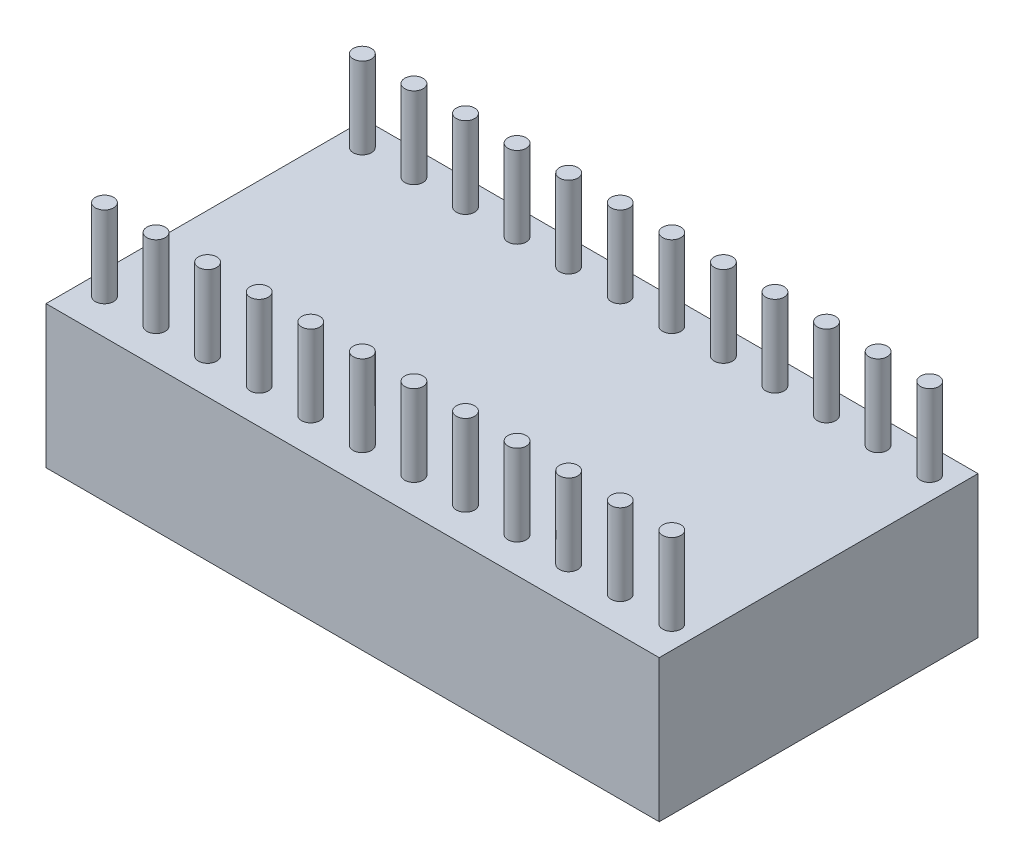
ISO-10303-21;
HEADER;
FILE_DESCRIPTION(('STEP AP214'),'2;1');
FILE_NAME('part.step','',(''),(''),'','','');
FILE_SCHEMA(('AUTOMOTIVE_DESIGN { 1 0 10303 214 1 1 1 1 }'));
ENDSEC;
DATA;
#1=APPLICATION_CONTEXT('core data for automotive mechanical design processes');
#2=APPLICATION_PROTOCOL_DEFINITION('international standard','automotive_design',2000,#1);
#3=PRODUCT_CONTEXT('',#1,'mechanical');
#4=PRODUCT('Part','Part','',(#3));
#5=PRODUCT_RELATED_PRODUCT_CATEGORY('part','',(#4));
#6=PRODUCT_DEFINITION_FORMATION('','',#4);
#7=PRODUCT_DEFINITION_CONTEXT('part definition',#1,'design');
#8=PRODUCT_DEFINITION('design','',#6,#7);
#9=PRODUCT_DEFINITION_SHAPE('','',#8);
#10=(LENGTH_UNIT() NAMED_UNIT(*) SI_UNIT(.MILLI.,.METRE.));
#11=(NAMED_UNIT(*) PLANE_ANGLE_UNIT() SI_UNIT($,.RADIAN.));
#12=(NAMED_UNIT(*) SI_UNIT($,.STERADIAN.) SOLID_ANGLE_UNIT());
#13=UNCERTAINTY_MEASURE_WITH_UNIT(LENGTH_MEASURE(1.E-05),#10,'distance_accuracy_value','');
#14=(GEOMETRIC_REPRESENTATION_CONTEXT(3) GLOBAL_UNCERTAINTY_ASSIGNED_CONTEXT((#13)) GLOBAL_UNIT_ASSIGNED_CONTEXT((#10,
#11,#12)) REPRESENTATION_CONTEXT('',''));
#15=CARTESIAN_POINT('',(0.,0.,0.));
#16=DIRECTION('',(0.,0.,1.));
#17=DIRECTION('',(1.,0.,0.));
#18=AXIS2_PLACEMENT_3D('',#15,#16,#17);
#19=CARTESIAN_POINT('',(0.,7.,0.));
#20=DIRECTION('',(1.,0.,0.));
#21=DIRECTION('',(0.,0.,-1.));
#22=AXIS2_PLACEMENT_3D('',#19,#20,#21);
#23=PLANE('',#22);
#24=DIRECTION('',(0.,0.,1.));
#25=VECTOR('',#24,1.);
#26=CARTESIAN_POINT('',(0.,0.,0.));
#27=LINE('',#26,#25);
#28=CARTESIAN_POINT('',(0.,0.,0.));
#29=VERTEX_POINT('',#28);
#30=CARTESIAN_POINT('',(0.,0.,15.7));
#31=VERTEX_POINT('',#30);
#32=EDGE_CURVE('E107',#29,#31,#27,.T.);
#33=ORIENTED_EDGE('',*,*,#32,.T.);
#34=DIRECTION('',(0.,-1.,0.));
#35=VECTOR('',#34,1.);
#36=CARTESIAN_POINT('',(0.,7.,15.7));
#37=LINE('',#36,#35);
#38=CARTESIAN_POINT('',(0.,7.,15.7));
#39=VERTEX_POINT('',#38);
#40=EDGE_CURVE('E11',#39,#31,#37,.T.);
#41=ORIENTED_EDGE('',*,*,#40,.F.);
#42=DIRECTION('',(0.,0.,1.));
#43=VECTOR('',#42,1.);
#44=CARTESIAN_POINT('',(0.,7.,0.));
#45=LINE('',#44,#43);
#46=CARTESIAN_POINT('',(0.,7.,0.));
#47=VERTEX_POINT('',#46);
#48=EDGE_CURVE('E91',#47,#39,#45,.T.);
#49=ORIENTED_EDGE('',*,*,#48,.F.);
#50=DIRECTION('',(0.,-1.,0.));
#51=VECTOR('',#50,1.);
#52=CARTESIAN_POINT('',(0.,7.,0.));
#53=LINE('',#52,#51);
#54=EDGE_CURVE('E103',#47,#29,#53,.T.);
#55=ORIENTED_EDGE('',*,*,#54,.T.);
#56=EDGE_LOOP('',(#33,#41,#49,#55));
#57=FACE_BOUND('',#56,.T.);
#58=ADVANCED_FACE('F39',(#57),#23,.F.);
#59=CARTESIAN_POINT('',(0.,7.,15.7));
#60=DIRECTION('',(0.,0.,-1.));
#61=DIRECTION('',(-1.,0.,0.));
#62=AXIS2_PLACEMENT_3D('',#59,#60,#61);
#63=PLANE('',#62);
#64=DIRECTION('',(1.,0.,0.));
#65=VECTOR('',#64,1.);
#66=CARTESIAN_POINT('',(0.,0.,15.7));
#67=LINE('',#66,#65);
#68=CARTESIAN_POINT('',(30.2,0.,15.7));
#69=VERTEX_POINT('',#68);
#70=EDGE_CURVE('E96',#31,#69,#67,.T.);
#71=ORIENTED_EDGE('',*,*,#70,.T.);
#72=DIRECTION('',(0.,-1.,0.));
#73=VECTOR('',#72,1.);
#74=CARTESIAN_POINT('',(30.2,7.,15.7));
#75=LINE('',#74,#73);
#76=CARTESIAN_POINT('',(30.2,7.,15.7));
#77=VERTEX_POINT('',#76);
#78=EDGE_CURVE('E48',#77,#69,#75,.T.);
#79=ORIENTED_EDGE('',*,*,#78,.F.);
#80=DIRECTION('',(1.,0.,0.));
#81=VECTOR('',#80,1.);
#82=CARTESIAN_POINT('',(0.,7.,15.7));
#83=LINE('',#82,#81);
#84=EDGE_CURVE('E86',#39,#77,#83,.T.);
#85=ORIENTED_EDGE('',*,*,#84,.F.);
#86=ORIENTED_EDGE('',*,*,#40,.T.);
#87=EDGE_LOOP('',(#71,#79,#85,#86));
#88=FACE_BOUND('',#87,.T.);
#89=ADVANCED_FACE('F95',(#88),#63,.F.);
#90=CARTESIAN_POINT('',(30.2,7.,0.));
#91=DIRECTION('',(-1.,0.,0.));
#92=DIRECTION('',(0.,0.,1.));
#93=AXIS2_PLACEMENT_3D('',#90,#91,#92);
#94=PLANE('',#93);
#95=DIRECTION('',(0.,0.,-1.));
#96=VECTOR('',#95,1.);
#97=CARTESIAN_POINT('',(30.2,0.,0.));
#98=LINE('',#97,#96);
#99=CARTESIAN_POINT('',(30.2,0.,0.));
#100=VERTEX_POINT('',#99);
#101=EDGE_CURVE('E73',#69,#100,#98,.T.);
#102=ORIENTED_EDGE('',*,*,#101,.T.);
#103=DIRECTION('',(0.,-1.,0.));
#104=VECTOR('',#103,1.);
#105=CARTESIAN_POINT('',(30.2,7.,0.));
#106=LINE('',#105,#104);
#107=CARTESIAN_POINT('',(30.2,7.,0.));
#108=VERTEX_POINT('',#107);
#109=EDGE_CURVE('E98',#108,#100,#106,.T.);
#110=ORIENTED_EDGE('',*,*,#109,.F.);
#111=DIRECTION('',(0.,0.,-1.));
#112=VECTOR('',#111,1.);
#113=CARTESIAN_POINT('',(30.2,7.,0.));
#114=LINE('',#113,#112);
#115=EDGE_CURVE('E89',#77,#108,#114,.T.);
#116=ORIENTED_EDGE('',*,*,#115,.F.);
#117=ORIENTED_EDGE('',*,*,#78,.T.);
#118=EDGE_LOOP('',(#102,#110,#116,#117));
#119=FACE_BOUND('',#118,.T.);
#120=ADVANCED_FACE('F99',(#119),#94,.F.);
#121=CARTESIAN_POINT('',(0.,7.,0.));
#122=DIRECTION('',(0.,0.,1.));
#123=DIRECTION('',(1.,0.,0.));
#124=AXIS2_PLACEMENT_3D('',#121,#122,#123);
#125=PLANE('',#124);
#126=DIRECTION('',(-1.,0.,0.));
#127=VECTOR('',#126,1.);
#128=CARTESIAN_POINT('',(0.,0.,0.));
#129=LINE('',#128,#127);
#130=EDGE_CURVE('E79',#100,#29,#129,.T.);
#131=ORIENTED_EDGE('',*,*,#130,.T.);
#132=ORIENTED_EDGE('',*,*,#54,.F.);
#133=DIRECTION('',(-1.,0.,0.));
#134=VECTOR('',#133,1.);
#135=CARTESIAN_POINT('',(0.,7.,0.));
#136=LINE('',#135,#134);
#137=EDGE_CURVE('E56',#108,#47,#136,.T.);
#138=ORIENTED_EDGE('',*,*,#137,.F.);
#139=ORIENTED_EDGE('',*,*,#109,.T.);
#140=EDGE_LOOP('',(#131,#132,#138,#139));
#141=FACE_BOUND('',#140,.T.);
#142=ADVANCED_FACE('F121',(#141),#125,.F.);
#143=CARTESIAN_POINT('',(0.,7.,0.));
#144=DIRECTION('',(0.,1.,0.));
#145=DIRECTION('',(0.,0.,1.));
#146=AXIS2_PLACEMENT_3D('',#143,#144,#145);
#147=PLANE('',#146);
#148=CARTESIAN_POINT('',(1.13,7.,13.95));
#149=DIRECTION('',(0.,1.,0.));
#150=DIRECTION('',(0.,0.,-1.));
#151=AXIS2_PLACEMENT_3D('',#148,#149,#150);
#152=CIRCLE('',#151,0.450000000000001);
#153=CARTESIAN_POINT('',(1.13,7.,13.5));
#154=VERTEX_POINT('',#153);
#155=EDGE_CURVE('E312',#154,#154,#152,.T.);
#156=ORIENTED_EDGE('',*,*,#155,.F.);
#157=EDGE_LOOP('',(#156));
#158=FACE_BOUND('',#157,.T.);
#159=CARTESIAN_POINT('',(3.67,7.,13.95));
#160=DIRECTION('',(0.,1.,0.));
#161=DIRECTION('',(0.,0.,-1.));
#162=AXIS2_PLACEMENT_3D('',#159,#160,#161);
#163=CIRCLE('',#162,0.450000000000001);
#164=CARTESIAN_POINT('',(3.67,7.,13.5));
#165=VERTEX_POINT('',#164);
#166=EDGE_CURVE('E304',#165,#165,#163,.T.);
#167=ORIENTED_EDGE('',*,*,#166,.F.);
#168=EDGE_LOOP('',(#167));
#169=FACE_BOUND('',#168,.T.);
#170=CARTESIAN_POINT('',(6.21,7.,13.95));
#171=DIRECTION('',(0.,1.,0.));
#172=DIRECTION('',(0.,0.,1.));
#173=AXIS2_PLACEMENT_3D('',#170,#171,#172);
#174=CIRCLE('',#173,0.450000000000001);
#175=CARTESIAN_POINT('',(6.21,7.,14.4));
#176=VERTEX_POINT('',#175);
#177=EDGE_CURVE('E296',#176,#176,#174,.T.);
#178=ORIENTED_EDGE('',*,*,#177,.F.);
#179=EDGE_LOOP('',(#178));
#180=FACE_BOUND('',#179,.T.);
#181=CARTESIAN_POINT('',(8.75,7.,13.95));
#182=DIRECTION('',(0.,1.,0.));
#183=DIRECTION('',(0.,0.,1.));
#184=AXIS2_PLACEMENT_3D('',#181,#182,#183);
#185=CIRCLE('',#184,0.450000000000002);
#186=CARTESIAN_POINT('',(8.75,7.,14.4));
#187=VERTEX_POINT('',#186);
#188=EDGE_CURVE('E288',#187,#187,#185,.T.);
#189=ORIENTED_EDGE('',*,*,#188,.F.);
#190=EDGE_LOOP('',(#189));
#191=FACE_BOUND('',#190,.T.);
#192=CARTESIAN_POINT('',(11.29,7.,13.95));
#193=DIRECTION('',(0.,1.,0.));
#194=DIRECTION('',(0.,0.,-1.));
#195=AXIS2_PLACEMENT_3D('',#192,#193,#194);
#196=CIRCLE('',#195,0.450000000000002);
#197=CARTESIAN_POINT('',(11.29,7.,13.5));
#198=VERTEX_POINT('',#197);
#199=EDGE_CURVE('E280',#198,#198,#196,.T.);
#200=ORIENTED_EDGE('',*,*,#199,.F.);
#201=EDGE_LOOP('',(#200));
#202=FACE_BOUND('',#201,.T.);
#203=CARTESIAN_POINT('',(13.83,7.,13.95));
#204=DIRECTION('',(0.,1.,0.));
#205=DIRECTION('',(0.,0.,-1.));
#206=AXIS2_PLACEMENT_3D('',#203,#204,#205);
#207=CIRCLE('',#206,0.450000000000002);
#208=CARTESIAN_POINT('',(13.83,7.,13.5));
#209=VERTEX_POINT('',#208);
#210=EDGE_CURVE('E272',#209,#209,#207,.T.);
#211=ORIENTED_EDGE('',*,*,#210,.F.);
#212=EDGE_LOOP('',(#211));
#213=FACE_BOUND('',#212,.T.);
#214=CARTESIAN_POINT('',(16.37,7.,13.95));
#215=DIRECTION('',(0.,1.,0.));
#216=DIRECTION('',(0.,0.,1.));
#217=AXIS2_PLACEMENT_3D('',#214,#215,#216);
#218=CIRCLE('',#217,0.450000000000002);
#219=CARTESIAN_POINT('',(16.37,7.,14.4));
#220=VERTEX_POINT('',#219);
#221=EDGE_CURVE('E264',#220,#220,#218,.T.);
#222=ORIENTED_EDGE('',*,*,#221,.F.);
#223=EDGE_LOOP('',(#222));
#224=FACE_BOUND('',#223,.T.);
#225=CARTESIAN_POINT('',(18.91,7.,13.95));
#226=DIRECTION('',(0.,1.,0.));
#227=DIRECTION('',(0.,0.,1.));
#228=AXIS2_PLACEMENT_3D('',#225,#226,#227);
#229=CIRCLE('',#228,0.449999999999995);
#230=CARTESIAN_POINT('',(18.91,7.,14.4));
#231=VERTEX_POINT('',#230);
#232=EDGE_CURVE('E256',#231,#231,#229,.T.);
#233=ORIENTED_EDGE('',*,*,#232,.F.);
#234=EDGE_LOOP('',(#233));
#235=FACE_BOUND('',#234,.T.);
#236=CARTESIAN_POINT('',(21.45,7.,13.95));
#237=DIRECTION('',(0.,1.,0.));
#238=DIRECTION('',(0.,0.,-1.));
#239=AXIS2_PLACEMENT_3D('',#236,#237,#238);
#240=CIRCLE('',#239,0.449999999999995);
#241=CARTESIAN_POINT('',(21.45,7.,13.5));
#242=VERTEX_POINT('',#241);
#243=EDGE_CURVE('E248',#242,#242,#240,.T.);
#244=ORIENTED_EDGE('',*,*,#243,.F.);
#245=EDGE_LOOP('',(#244));
#246=FACE_BOUND('',#245,.T.);
#247=CARTESIAN_POINT('',(23.99,7.,13.95));
#248=DIRECTION('',(0.,1.,0.));
#249=DIRECTION('',(0.,0.,-1.));
#250=AXIS2_PLACEMENT_3D('',#247,#248,#249);
#251=CIRCLE('',#250,0.450000000000002);
#252=CARTESIAN_POINT('',(23.99,7.,13.5));
#253=VERTEX_POINT('',#252);
#254=EDGE_CURVE('E240',#253,#253,#251,.T.);
#255=ORIENTED_EDGE('',*,*,#254,.F.);
#256=EDGE_LOOP('',(#255));
#257=FACE_BOUND('',#256,.T.);
#258=CARTESIAN_POINT('',(26.53,7.,13.95));
#259=DIRECTION('',(0.,1.,0.));
#260=DIRECTION('',(0.,0.,1.));
#261=AXIS2_PLACEMENT_3D('',#258,#259,#260);
#262=CIRCLE('',#261,0.450000000000002);
#263=CARTESIAN_POINT('',(26.53,7.,14.4));
#264=VERTEX_POINT('',#263);
#265=EDGE_CURVE('E232',#264,#264,#262,.T.);
#266=ORIENTED_EDGE('',*,*,#265,.F.);
#267=EDGE_LOOP('',(#266));
#268=FACE_BOUND('',#267,.T.);
#269=CARTESIAN_POINT('',(29.07,7.,13.95));
#270=DIRECTION('',(0.,1.,0.));
#271=DIRECTION('',(0.,0.,1.));
#272=AXIS2_PLACEMENT_3D('',#269,#270,#271);
#273=CIRCLE('',#272,0.450000000000002);
#274=CARTESIAN_POINT('',(29.07,7.,14.4));
#275=VERTEX_POINT('',#274);
#276=EDGE_CURVE('E224',#275,#275,#273,.T.);
#277=ORIENTED_EDGE('',*,*,#276,.F.);
#278=EDGE_LOOP('',(#277));
#279=FACE_BOUND('',#278,.T.);
#280=CARTESIAN_POINT('',(29.07,7.,1.25));
#281=DIRECTION('',(0.,1.,0.));
#282=DIRECTION('',(0.,0.,-1.));
#283=AXIS2_PLACEMENT_3D('',#280,#281,#282);
#284=CIRCLE('',#283,0.450000000000002);
#285=CARTESIAN_POINT('',(29.07,7.,0.799999999999998));
#286=VERTEX_POINT('',#285);
#287=EDGE_CURVE('E216',#286,#286,#284,.T.);
#288=ORIENTED_EDGE('',*,*,#287,.F.);
#289=EDGE_LOOP('',(#288));
#290=FACE_BOUND('',#289,.T.);
#291=CARTESIAN_POINT('',(26.53,7.,1.25));
#292=DIRECTION('',(0.,1.,0.));
#293=DIRECTION('',(0.,0.,-1.));
#294=AXIS2_PLACEMENT_3D('',#291,#292,#293);
#295=CIRCLE('',#294,0.450000000000002);
#296=CARTESIAN_POINT('',(26.53,7.,0.799999999999998));
#297=VERTEX_POINT('',#296);
#298=EDGE_CURVE('E208',#297,#297,#295,.T.);
#299=ORIENTED_EDGE('',*,*,#298,.F.);
#300=EDGE_LOOP('',(#299));
#301=FACE_BOUND('',#300,.T.);
#302=CARTESIAN_POINT('',(23.99,7.,1.25));
#303=DIRECTION('',(0.,1.,0.));
#304=DIRECTION('',(0.,0.,1.));
#305=AXIS2_PLACEMENT_3D('',#302,#303,#304);
#306=CIRCLE('',#305,0.450000000000002);
#307=CARTESIAN_POINT('',(23.99,7.,1.7));
#308=VERTEX_POINT('',#307);
#309=EDGE_CURVE('E200',#308,#308,#306,.T.);
#310=ORIENTED_EDGE('',*,*,#309,.F.);
#311=EDGE_LOOP('',(#310));
#312=FACE_BOUND('',#311,.T.);
#313=CARTESIAN_POINT('',(21.45,7.,1.25));
#314=DIRECTION('',(0.,1.,0.));
#315=DIRECTION('',(0.,0.,1.));
#316=AXIS2_PLACEMENT_3D('',#313,#314,#315);
#317=CIRCLE('',#316,0.449999999999995);
#318=CARTESIAN_POINT('',(21.45,7.,1.7));
#319=VERTEX_POINT('',#318);
#320=EDGE_CURVE('E192',#319,#319,#317,.T.);
#321=ORIENTED_EDGE('',*,*,#320,.F.);
#322=EDGE_LOOP('',(#321));
#323=FACE_BOUND('',#322,.T.);
#324=CARTESIAN_POINT('',(18.91,7.,1.25));
#325=DIRECTION('',(0.,1.,0.));
#326=DIRECTION('',(0.,0.,-1.));
#327=AXIS2_PLACEMENT_3D('',#324,#325,#326);
#328=CIRCLE('',#327,0.449999999999995);
#329=CARTESIAN_POINT('',(18.91,7.,0.800000000000005));
#330=VERTEX_POINT('',#329);
#331=EDGE_CURVE('E184',#330,#330,#328,.T.);
#332=ORIENTED_EDGE('',*,*,#331,.F.);
#333=EDGE_LOOP('',(#332));
#334=FACE_BOUND('',#333,.T.);
#335=CARTESIAN_POINT('',(16.37,7.,1.25));
#336=DIRECTION('',(0.,1.,0.));
#337=DIRECTION('',(0.,0.,-1.));
#338=AXIS2_PLACEMENT_3D('',#335,#336,#337);
#339=CIRCLE('',#338,0.450000000000002);
#340=CARTESIAN_POINT('',(16.37,7.,0.799999999999998));
#341=VERTEX_POINT('',#340);
#342=EDGE_CURVE('E176',#341,#341,#339,.T.);
#343=ORIENTED_EDGE('',*,*,#342,.F.);
#344=EDGE_LOOP('',(#343));
#345=FACE_BOUND('',#344,.T.);
#346=CARTESIAN_POINT('',(13.83,7.,1.25));
#347=DIRECTION('',(0.,1.,0.));
#348=DIRECTION('',(0.,0.,1.));
#349=AXIS2_PLACEMENT_3D('',#346,#347,#348);
#350=CIRCLE('',#349,0.450000000000002);
#351=CARTESIAN_POINT('',(13.83,7.,1.7));
#352=VERTEX_POINT('',#351);
#353=EDGE_CURVE('E168',#352,#352,#350,.T.);
#354=ORIENTED_EDGE('',*,*,#353,.F.);
#355=EDGE_LOOP('',(#354));
#356=FACE_BOUND('',#355,.T.);
#357=CARTESIAN_POINT('',(11.29,7.,1.25));
#358=DIRECTION('',(0.,1.,0.));
#359=DIRECTION('',(0.,0.,1.));
#360=AXIS2_PLACEMENT_3D('',#357,#358,#359);
#361=CIRCLE('',#360,0.450000000000002);
#362=CARTESIAN_POINT('',(11.29,7.,1.7));
#363=VERTEX_POINT('',#362);
#364=EDGE_CURVE('E160',#363,#363,#361,.T.);
#365=ORIENTED_EDGE('',*,*,#364,.F.);
#366=EDGE_LOOP('',(#365));
#367=FACE_BOUND('',#366,.T.);
#368=CARTESIAN_POINT('',(8.75,7.,1.25));
#369=DIRECTION('',(0.,1.,0.));
#370=DIRECTION('',(0.,0.,-1.));
#371=AXIS2_PLACEMENT_3D('',#368,#369,#370);
#372=CIRCLE('',#371,0.450000000000002);
#373=CARTESIAN_POINT('',(8.75,7.,0.799999999999998));
#374=VERTEX_POINT('',#373);
#375=EDGE_CURVE('E152',#374,#374,#372,.T.);
#376=ORIENTED_EDGE('',*,*,#375,.F.);
#377=EDGE_LOOP('',(#376));
#378=FACE_BOUND('',#377,.T.);
#379=CARTESIAN_POINT('',(6.21,7.,1.25));
#380=DIRECTION('',(0.,1.,0.));
#381=DIRECTION('',(0.,0.,-1.));
#382=AXIS2_PLACEMENT_3D('',#379,#380,#381);
#383=CIRCLE('',#382,0.450000000000001);
#384=CARTESIAN_POINT('',(6.21,7.,0.799999999999999));
#385=VERTEX_POINT('',#384);
#386=EDGE_CURVE('E144',#385,#385,#383,.T.);
#387=ORIENTED_EDGE('',*,*,#386,.F.);
#388=EDGE_LOOP('',(#387));
#389=FACE_BOUND('',#388,.T.);
#390=CARTESIAN_POINT('',(3.67,7.,1.25));
#391=DIRECTION('',(0.,1.,0.));
#392=DIRECTION('',(0.,0.,1.));
#393=AXIS2_PLACEMENT_3D('',#390,#391,#392);
#394=CIRCLE('',#393,0.450000000000001);
#395=CARTESIAN_POINT('',(3.67,7.,1.7));
#396=VERTEX_POINT('',#395);
#397=EDGE_CURVE('E136',#396,#396,#394,.T.);
#398=ORIENTED_EDGE('',*,*,#397,.F.);
#399=EDGE_LOOP('',(#398));
#400=FACE_BOUND('',#399,.T.);
#401=CARTESIAN_POINT('',(1.13,7.,1.25));
#402=DIRECTION('',(0.,1.,0.));
#403=DIRECTION('',(0.,0.,1.));
#404=AXIS2_PLACEMENT_3D('',#401,#402,#403);
#405=CIRCLE('',#404,0.45);
#406=CARTESIAN_POINT('',(1.13,7.,1.7));
#407=VERTEX_POINT('',#406);
#408=EDGE_CURVE('E128',#407,#407,#405,.T.);
#409=ORIENTED_EDGE('',*,*,#408,.F.);
#410=EDGE_LOOP('',(#409));
#411=FACE_BOUND('',#410,.T.);
#412=ORIENTED_EDGE('',*,*,#48,.T.);
#413=ORIENTED_EDGE('',*,*,#84,.T.);
#414=ORIENTED_EDGE('',*,*,#115,.T.);
#415=ORIENTED_EDGE('',*,*,#137,.T.);
#416=EDGE_LOOP('',(#412,#413,#414,#415));
#417=FACE_BOUND('',#416,.T.);
#418=ADVANCED_FACE('F87',(#158,#169,#180,#191,#202,#213,#224,#235,#246,#257,#268,#279,#290,#301,
#312,#323,#334,#345,#356,#367,#378,#389,#400,#411,#417),#147,.T.);
#419=CARTESIAN_POINT('',(0.,0.,0.));
#420=DIRECTION('',(0.,1.,0.));
#421=DIRECTION('',(0.,0.,1.));
#422=AXIS2_PLACEMENT_3D('',#419,#420,#421);
#423=PLANE('',#422);
#424=ORIENTED_EDGE('',*,*,#32,.F.);
#425=ORIENTED_EDGE('',*,*,#130,.F.);
#426=ORIENTED_EDGE('',*,*,#101,.F.);
#427=ORIENTED_EDGE('',*,*,#70,.F.);
#428=EDGE_LOOP('',(#424,#425,#426,#427));
#429=FACE_BOUND('',#428,.T.);
#430=ADVANCED_FACE('F124',(#429),#423,.F.);
#431=CARTESIAN_POINT('',(1.13,11.,1.25));
#432=DIRECTION('',(0.,-1.,0.));
#433=DIRECTION('',(0.,0.,-1.));
#434=AXIS2_PLACEMENT_3D('',#431,#432,#433);
#435=CYLINDRICAL_SURFACE('',#434,0.45);
#436=CARTESIAN_POINT('',(1.13,11.,1.25));
#437=DIRECTION('',(0.,1.,0.));
#438=DIRECTION('',(0.,0.,1.));
#439=AXIS2_PLACEMENT_3D('',#436,#437,#438);
#440=CIRCLE('',#439,0.45);
#441=CARTESIAN_POINT('',(1.13,11.,1.7));
#442=VERTEX_POINT('',#441);
#443=EDGE_CURVE('E111',#442,#442,#440,.T.);
#444=ORIENTED_EDGE('',*,*,#443,.F.);
#445=EDGE_LOOP('',(#444));
#446=FACE_BOUND('',#445,.T.);
#447=ORIENTED_EDGE('',*,*,#408,.T.);
#448=EDGE_LOOP('',(#447));
#449=FACE_BOUND('',#448,.T.);
#450=ADVANCED_FACE('F378',(#446,#449),#435,.T.);
#451=CARTESIAN_POINT('',(1.13,11.,1.25));
#452=DIRECTION('',(0.,1.,0.));
#453=DIRECTION('',(0.,0.,1.));
#454=AXIS2_PLACEMENT_3D('',#451,#452,#453);
#455=PLANE('',#454);
#456=ORIENTED_EDGE('',*,*,#443,.T.);
#457=EDGE_LOOP('',(#456));
#458=FACE_BOUND('',#457,.T.);
#459=ADVANCED_FACE('F380',(#458),#455,.T.);
#460=CARTESIAN_POINT('',(3.67,11.,1.25));
#461=DIRECTION('',(0.,-1.,0.));
#462=DIRECTION('',(0.,0.,-1.));
#463=AXIS2_PLACEMENT_3D('',#460,#461,#462);
#464=CYLINDRICAL_SURFACE('',#463,0.450000000000001);
#465=CARTESIAN_POINT('',(3.67,11.,1.25));
#466=DIRECTION('',(0.,1.,0.));
#467=DIRECTION('',(0.,0.,1.));
#468=AXIS2_PLACEMENT_3D('',#465,#466,#467);
#469=CIRCLE('',#468,0.450000000000001);
#470=CARTESIAN_POINT('',(3.67,11.,1.7));
#471=VERTEX_POINT('',#470);
#472=EDGE_CURVE('E132',#471,#471,#469,.T.);
#473=ORIENTED_EDGE('',*,*,#472,.F.);
#474=EDGE_LOOP('',(#473));
#475=FACE_BOUND('',#474,.T.);
#476=ORIENTED_EDGE('',*,*,#397,.T.);
#477=EDGE_LOOP('',(#476));
#478=FACE_BOUND('',#477,.T.);
#479=ADVANCED_FACE('F387',(#475,#478),#464,.T.);
#480=CARTESIAN_POINT('',(3.67,11.,1.25));
#481=DIRECTION('',(0.,1.,0.));
#482=DIRECTION('',(0.,0.,1.));
#483=AXIS2_PLACEMENT_3D('',#480,#481,#482);
#484=PLANE('',#483);
#485=ORIENTED_EDGE('',*,*,#472,.T.);
#486=EDGE_LOOP('',(#485));
#487=FACE_BOUND('',#486,.T.);
#488=ADVANCED_FACE('F435',(#487),#484,.T.);
#489=CARTESIAN_POINT('',(6.21,11.,1.25));
#490=DIRECTION('',(0.,-1.,0.));
#491=DIRECTION('',(0.,0.,-1.));
#492=AXIS2_PLACEMENT_3D('',#489,#490,#491);
#493=CYLINDRICAL_SURFACE('',#492,0.450000000000001);
#494=CARTESIAN_POINT('',(6.21,11.,1.25));
#495=DIRECTION('',(0.,1.,0.));
#496=DIRECTION('',(0.,0.,-1.));
#497=AXIS2_PLACEMENT_3D('',#494,#495,#496);
#498=CIRCLE('',#497,0.450000000000001);
#499=CARTESIAN_POINT('',(6.21,11.,0.799999999999999));
#500=VERTEX_POINT('',#499);
#501=EDGE_CURVE('E140',#500,#500,#498,.T.);
#502=ORIENTED_EDGE('',*,*,#501,.F.);
#503=EDGE_LOOP('',(#502));
#504=FACE_BOUND('',#503,.T.);
#505=ORIENTED_EDGE('',*,*,#386,.T.);
#506=EDGE_LOOP('',(#505));
#507=FACE_BOUND('',#506,.T.);
#508=ADVANCED_FACE('F444',(#504,#507),#493,.T.);
#509=CARTESIAN_POINT('',(6.21,11.,1.25));
#510=DIRECTION('',(0.,-1.,0.));
#511=DIRECTION('',(0.,0.,-1.));
#512=AXIS2_PLACEMENT_3D('',#509,#510,#511);
#513=PLANE('',#512);
#514=ORIENTED_EDGE('',*,*,#501,.T.);
#515=EDGE_LOOP('',(#514));
#516=FACE_BOUND('',#515,.T.);
#517=ADVANCED_FACE('F453',(#516),#513,.F.);
#518=CARTESIAN_POINT('',(8.75,11.,1.25));
#519=DIRECTION('',(0.,-1.,0.));
#520=DIRECTION('',(0.,0.,-1.));
#521=AXIS2_PLACEMENT_3D('',#518,#519,#520);
#522=CYLINDRICAL_SURFACE('',#521,0.450000000000002);
#523=CARTESIAN_POINT('',(8.75,11.,1.25));
#524=DIRECTION('',(0.,1.,0.));
#525=DIRECTION('',(0.,0.,-1.));
#526=AXIS2_PLACEMENT_3D('',#523,#524,#525);
#527=CIRCLE('',#526,0.450000000000002);
#528=CARTESIAN_POINT('',(8.75,11.,0.799999999999998));
#529=VERTEX_POINT('',#528);
#530=EDGE_CURVE('E148',#529,#529,#527,.T.);
#531=ORIENTED_EDGE('',*,*,#530,.F.);
#532=EDGE_LOOP('',(#531));
#533=FACE_BOUND('',#532,.T.);
#534=ORIENTED_EDGE('',*,*,#375,.T.);
#535=EDGE_LOOP('',(#534));
#536=FACE_BOUND('',#535,.T.);
#537=ADVANCED_FACE('F462',(#533,#536),#522,.T.);
#538=CARTESIAN_POINT('',(8.75,11.,1.25));
#539=DIRECTION('',(0.,-1.,0.));
#540=DIRECTION('',(0.,0.,-1.));
#541=AXIS2_PLACEMENT_3D('',#538,#539,#540);
#542=PLANE('',#541);
#543=ORIENTED_EDGE('',*,*,#530,.T.);
#544=EDGE_LOOP('',(#543));
#545=FACE_BOUND('',#544,.T.);
#546=ADVANCED_FACE('F471',(#545),#542,.F.);
#547=CARTESIAN_POINT('',(11.29,11.,1.25));
#548=DIRECTION('',(0.,-1.,0.));
#549=DIRECTION('',(0.,0.,-1.));
#550=AXIS2_PLACEMENT_3D('',#547,#548,#549);
#551=CYLINDRICAL_SURFACE('',#550,0.450000000000002);
#552=CARTESIAN_POINT('',(11.29,11.,1.25));
#553=DIRECTION('',(0.,1.,0.));
#554=DIRECTION('',(0.,0.,1.));
#555=AXIS2_PLACEMENT_3D('',#552,#553,#554);
#556=CIRCLE('',#555,0.450000000000002);
#557=CARTESIAN_POINT('',(11.29,11.,1.7));
#558=VERTEX_POINT('',#557);
#559=EDGE_CURVE('E156',#558,#558,#556,.T.);
#560=ORIENTED_EDGE('',*,*,#559,.F.);
#561=EDGE_LOOP('',(#560));
#562=FACE_BOUND('',#561,.T.);
#563=ORIENTED_EDGE('',*,*,#364,.T.);
#564=EDGE_LOOP('',(#563));
#565=FACE_BOUND('',#564,.T.);
#566=ADVANCED_FACE('F480',(#562,#565),#551,.T.);
#567=CARTESIAN_POINT('',(11.29,11.,1.25));
#568=DIRECTION('',(0.,1.,0.));
#569=DIRECTION('',(0.,0.,1.));
#570=AXIS2_PLACEMENT_3D('',#567,#568,#569);
#571=PLANE('',#570);
#572=ORIENTED_EDGE('',*,*,#559,.T.);
#573=EDGE_LOOP('',(#572));
#574=FACE_BOUND('',#573,.T.);
#575=ADVANCED_FACE('F489',(#574),#571,.T.);
#576=CARTESIAN_POINT('',(13.83,11.,1.25));
#577=DIRECTION('',(0.,-1.,0.));
#578=DIRECTION('',(0.,0.,-1.));
#579=AXIS2_PLACEMENT_3D('',#576,#577,#578);
#580=CYLINDRICAL_SURFACE('',#579,0.450000000000002);
#581=CARTESIAN_POINT('',(13.83,11.,1.25));
#582=DIRECTION('',(0.,1.,0.));
#583=DIRECTION('',(0.,0.,1.));
#584=AXIS2_PLACEMENT_3D('',#581,#582,#583);
#585=CIRCLE('',#584,0.450000000000002);
#586=CARTESIAN_POINT('',(13.83,11.,1.7));
#587=VERTEX_POINT('',#586);
#588=EDGE_CURVE('E164',#587,#587,#585,.T.);
#589=ORIENTED_EDGE('',*,*,#588,.F.);
#590=EDGE_LOOP('',(#589));
#591=FACE_BOUND('',#590,.T.);
#592=ORIENTED_EDGE('',*,*,#353,.T.);
#593=EDGE_LOOP('',(#592));
#594=FACE_BOUND('',#593,.T.);
#595=ADVANCED_FACE('F498',(#591,#594),#580,.T.);
#596=CARTESIAN_POINT('',(13.83,11.,1.25));
#597=DIRECTION('',(0.,1.,0.));
#598=DIRECTION('',(0.,0.,1.));
#599=AXIS2_PLACEMENT_3D('',#596,#597,#598);
#600=PLANE('',#599);
#601=ORIENTED_EDGE('',*,*,#588,.T.);
#602=EDGE_LOOP('',(#601));
#603=FACE_BOUND('',#602,.T.);
#604=ADVANCED_FACE('F507',(#603),#600,.T.);
#605=CARTESIAN_POINT('',(16.37,11.,1.25));
#606=DIRECTION('',(0.,-1.,0.));
#607=DIRECTION('',(0.,0.,-1.));
#608=AXIS2_PLACEMENT_3D('',#605,#606,#607);
#609=CYLINDRICAL_SURFACE('',#608,0.450000000000002);
#610=CARTESIAN_POINT('',(16.37,11.,1.25));
#611=DIRECTION('',(0.,1.,0.));
#612=DIRECTION('',(0.,0.,-1.));
#613=AXIS2_PLACEMENT_3D('',#610,#611,#612);
#614=CIRCLE('',#613,0.450000000000002);
#615=CARTESIAN_POINT('',(16.37,11.,0.799999999999998));
#616=VERTEX_POINT('',#615);
#617=EDGE_CURVE('E172',#616,#616,#614,.T.);
#618=ORIENTED_EDGE('',*,*,#617,.F.);
#619=EDGE_LOOP('',(#618));
#620=FACE_BOUND('',#619,.T.);
#621=ORIENTED_EDGE('',*,*,#342,.T.);
#622=EDGE_LOOP('',(#621));
#623=FACE_BOUND('',#622,.T.);
#624=ADVANCED_FACE('F516',(#620,#623),#609,.T.);
#625=CARTESIAN_POINT('',(16.37,11.,1.25));
#626=DIRECTION('',(0.,-1.,0.));
#627=DIRECTION('',(0.,0.,-1.));
#628=AXIS2_PLACEMENT_3D('',#625,#626,#627);
#629=PLANE('',#628);
#630=ORIENTED_EDGE('',*,*,#617,.T.);
#631=EDGE_LOOP('',(#630));
#632=FACE_BOUND('',#631,.T.);
#633=ADVANCED_FACE('F525',(#632),#629,.F.);
#634=CARTESIAN_POINT('',(18.91,11.,1.25));
#635=DIRECTION('',(0.,-1.,0.));
#636=DIRECTION('',(0.,0.,-1.));
#637=AXIS2_PLACEMENT_3D('',#634,#635,#636);
#638=CYLINDRICAL_SURFACE('',#637,0.449999999999995);
#639=CARTESIAN_POINT('',(18.91,11.,1.25));
#640=DIRECTION('',(0.,1.,0.));
#641=DIRECTION('',(0.,0.,-1.));
#642=AXIS2_PLACEMENT_3D('',#639,#640,#641);
#643=CIRCLE('',#642,0.449999999999995);
#644=CARTESIAN_POINT('',(18.91,11.,0.800000000000005));
#645=VERTEX_POINT('',#644);
#646=EDGE_CURVE('E180',#645,#645,#643,.T.);
#647=ORIENTED_EDGE('',*,*,#646,.F.);
#648=EDGE_LOOP('',(#647));
#649=FACE_BOUND('',#648,.T.);
#650=ORIENTED_EDGE('',*,*,#331,.T.);
#651=EDGE_LOOP('',(#650));
#652=FACE_BOUND('',#651,.T.);
#653=ADVANCED_FACE('F534',(#649,#652),#638,.T.);
#654=CARTESIAN_POINT('',(18.91,11.,1.25));
#655=DIRECTION('',(0.,-1.,0.));
#656=DIRECTION('',(0.,0.,-1.));
#657=AXIS2_PLACEMENT_3D('',#654,#655,#656);
#658=PLANE('',#657);
#659=ORIENTED_EDGE('',*,*,#646,.T.);
#660=EDGE_LOOP('',(#659));
#661=FACE_BOUND('',#660,.T.);
#662=ADVANCED_FACE('F543',(#661),#658,.F.);
#663=CARTESIAN_POINT('',(21.45,11.,1.25));
#664=DIRECTION('',(0.,-1.,0.));
#665=DIRECTION('',(0.,0.,-1.));
#666=AXIS2_PLACEMENT_3D('',#663,#664,#665);
#667=CYLINDRICAL_SURFACE('',#666,0.449999999999995);
#668=CARTESIAN_POINT('',(21.45,11.,1.25));
#669=DIRECTION('',(0.,1.,0.));
#670=DIRECTION('',(0.,0.,1.));
#671=AXIS2_PLACEMENT_3D('',#668,#669,#670);
#672=CIRCLE('',#671,0.449999999999995);
#673=CARTESIAN_POINT('',(21.45,11.,1.7));
#674=VERTEX_POINT('',#673);
#675=EDGE_CURVE('E188',#674,#674,#672,.T.);
#676=ORIENTED_EDGE('',*,*,#675,.F.);
#677=EDGE_LOOP('',(#676));
#678=FACE_BOUND('',#677,.T.);
#679=ORIENTED_EDGE('',*,*,#320,.T.);
#680=EDGE_LOOP('',(#679));
#681=FACE_BOUND('',#680,.T.);
#682=ADVANCED_FACE('F552',(#678,#681),#667,.T.);
#683=CARTESIAN_POINT('',(21.45,11.,1.25));
#684=DIRECTION('',(0.,1.,0.));
#685=DIRECTION('',(0.,0.,1.));
#686=AXIS2_PLACEMENT_3D('',#683,#684,#685);
#687=PLANE('',#686);
#688=ORIENTED_EDGE('',*,*,#675,.T.);
#689=EDGE_LOOP('',(#688));
#690=FACE_BOUND('',#689,.T.);
#691=ADVANCED_FACE('F561',(#690),#687,.T.);
#692=CARTESIAN_POINT('',(23.99,11.,1.25));
#693=DIRECTION('',(0.,-1.,0.));
#694=DIRECTION('',(0.,0.,-1.));
#695=AXIS2_PLACEMENT_3D('',#692,#693,#694);
#696=CYLINDRICAL_SURFACE('',#695,0.450000000000002);
#697=CARTESIAN_POINT('',(23.99,11.,1.25));
#698=DIRECTION('',(0.,1.,0.));
#699=DIRECTION('',(0.,0.,1.));
#700=AXIS2_PLACEMENT_3D('',#697,#698,#699);
#701=CIRCLE('',#700,0.450000000000002);
#702=CARTESIAN_POINT('',(23.99,11.,1.7));
#703=VERTEX_POINT('',#702);
#704=EDGE_CURVE('E196',#703,#703,#701,.T.);
#705=ORIENTED_EDGE('',*,*,#704,.F.);
#706=EDGE_LOOP('',(#705));
#707=FACE_BOUND('',#706,.T.);
#708=ORIENTED_EDGE('',*,*,#309,.T.);
#709=EDGE_LOOP('',(#708));
#710=FACE_BOUND('',#709,.T.);
#711=ADVANCED_FACE('F570',(#707,#710),#696,.T.);
#712=CARTESIAN_POINT('',(23.99,11.,1.25));
#713=DIRECTION('',(0.,1.,0.));
#714=DIRECTION('',(0.,0.,1.));
#715=AXIS2_PLACEMENT_3D('',#712,#713,#714);
#716=PLANE('',#715);
#717=ORIENTED_EDGE('',*,*,#704,.T.);
#718=EDGE_LOOP('',(#717));
#719=FACE_BOUND('',#718,.T.);
#720=ADVANCED_FACE('F579',(#719),#716,.T.);
#721=CARTESIAN_POINT('',(26.53,11.,1.25));
#722=DIRECTION('',(0.,-1.,0.));
#723=DIRECTION('',(0.,0.,-1.));
#724=AXIS2_PLACEMENT_3D('',#721,#722,#723);
#725=CYLINDRICAL_SURFACE('',#724,0.450000000000002);
#726=CARTESIAN_POINT('',(26.53,11.,1.25));
#727=DIRECTION('',(0.,1.,0.));
#728=DIRECTION('',(0.,0.,-1.));
#729=AXIS2_PLACEMENT_3D('',#726,#727,#728);
#730=CIRCLE('',#729,0.450000000000002);
#731=CARTESIAN_POINT('',(26.53,11.,0.799999999999998));
#732=VERTEX_POINT('',#731);
#733=EDGE_CURVE('E204',#732,#732,#730,.T.);
#734=ORIENTED_EDGE('',*,*,#733,.F.);
#735=EDGE_LOOP('',(#734));
#736=FACE_BOUND('',#735,.T.);
#737=ORIENTED_EDGE('',*,*,#298,.T.);
#738=EDGE_LOOP('',(#737));
#739=FACE_BOUND('',#738,.T.);
#740=ADVANCED_FACE('F588',(#736,#739),#725,.T.);
#741=CARTESIAN_POINT('',(26.53,11.,1.25));
#742=DIRECTION('',(0.,-1.,0.));
#743=DIRECTION('',(0.,0.,-1.));
#744=AXIS2_PLACEMENT_3D('',#741,#742,#743);
#745=PLANE('',#744);
#746=ORIENTED_EDGE('',*,*,#733,.T.);
#747=EDGE_LOOP('',(#746));
#748=FACE_BOUND('',#747,.T.);
#749=ADVANCED_FACE('F597',(#748),#745,.F.);
#750=CARTESIAN_POINT('',(29.07,11.,1.25));
#751=DIRECTION('',(0.,-1.,0.));
#752=DIRECTION('',(0.,0.,-1.));
#753=AXIS2_PLACEMENT_3D('',#750,#751,#752);
#754=CYLINDRICAL_SURFACE('',#753,0.450000000000002);
#755=CARTESIAN_POINT('',(29.07,11.,1.25));
#756=DIRECTION('',(0.,1.,0.));
#757=DIRECTION('',(0.,0.,-1.));
#758=AXIS2_PLACEMENT_3D('',#755,#756,#757);
#759=CIRCLE('',#758,0.450000000000002);
#760=CARTESIAN_POINT('',(29.07,11.,0.799999999999998));
#761=VERTEX_POINT('',#760);
#762=EDGE_CURVE('E212',#761,#761,#759,.T.);
#763=ORIENTED_EDGE('',*,*,#762,.F.);
#764=EDGE_LOOP('',(#763));
#765=FACE_BOUND('',#764,.T.);
#766=ORIENTED_EDGE('',*,*,#287,.T.);
#767=EDGE_LOOP('',(#766));
#768=FACE_BOUND('',#767,.T.);
#769=ADVANCED_FACE('F606',(#765,#768),#754,.T.);
#770=CARTESIAN_POINT('',(29.07,11.,1.25));
#771=DIRECTION('',(0.,-1.,0.));
#772=DIRECTION('',(0.,0.,-1.));
#773=AXIS2_PLACEMENT_3D('',#770,#771,#772);
#774=PLANE('',#773);
#775=ORIENTED_EDGE('',*,*,#762,.T.);
#776=EDGE_LOOP('',(#775));
#777=FACE_BOUND('',#776,.T.);
#778=ADVANCED_FACE('F615',(#777),#774,.F.);
#779=CARTESIAN_POINT('',(29.07,11.,13.95));
#780=DIRECTION('',(0.,-1.,0.));
#781=DIRECTION('',(0.,0.,-1.));
#782=AXIS2_PLACEMENT_3D('',#779,#780,#781);
#783=CYLINDRICAL_SURFACE('',#782,0.450000000000002);
#784=CARTESIAN_POINT('',(29.07,11.,13.95));
#785=DIRECTION('',(0.,1.,0.));
#786=DIRECTION('',(0.,0.,1.));
#787=AXIS2_PLACEMENT_3D('',#784,#785,#786);
#788=CIRCLE('',#787,0.450000000000002);
#789=CARTESIAN_POINT('',(29.07,11.,14.4));
#790=VERTEX_POINT('',#789);
#791=EDGE_CURVE('E220',#790,#790,#788,.T.);
#792=ORIENTED_EDGE('',*,*,#791,.F.);
#793=EDGE_LOOP('',(#792));
#794=FACE_BOUND('',#793,.T.);
#795=ORIENTED_EDGE('',*,*,#276,.T.);
#796=EDGE_LOOP('',(#795));
#797=FACE_BOUND('',#796,.T.);
#798=ADVANCED_FACE('F624',(#794,#797),#783,.T.);
#799=CARTESIAN_POINT('',(29.07,11.,13.95));
#800=DIRECTION('',(0.,1.,0.));
#801=DIRECTION('',(0.,0.,1.));
#802=AXIS2_PLACEMENT_3D('',#799,#800,#801);
#803=PLANE('',#802);
#804=ORIENTED_EDGE('',*,*,#791,.T.);
#805=EDGE_LOOP('',(#804));
#806=FACE_BOUND('',#805,.T.);
#807=ADVANCED_FACE('F633',(#806),#803,.T.);
#808=CARTESIAN_POINT('',(26.53,11.,13.95));
#809=DIRECTION('',(0.,-1.,0.));
#810=DIRECTION('',(0.,0.,-1.));
#811=AXIS2_PLACEMENT_3D('',#808,#809,#810);
#812=CYLINDRICAL_SURFACE('',#811,0.450000000000002);
#813=CARTESIAN_POINT('',(26.53,11.,13.95));
#814=DIRECTION('',(0.,1.,0.));
#815=DIRECTION('',(0.,0.,1.));
#816=AXIS2_PLACEMENT_3D('',#813,#814,#815);
#817=CIRCLE('',#816,0.450000000000002);
#818=CARTESIAN_POINT('',(26.53,11.,14.4));
#819=VERTEX_POINT('',#818);
#820=EDGE_CURVE('E228',#819,#819,#817,.T.);
#821=ORIENTED_EDGE('',*,*,#820,.F.);
#822=EDGE_LOOP('',(#821));
#823=FACE_BOUND('',#822,.T.);
#824=ORIENTED_EDGE('',*,*,#265,.T.);
#825=EDGE_LOOP('',(#824));
#826=FACE_BOUND('',#825,.T.);
#827=ADVANCED_FACE('F642',(#823,#826),#812,.T.);
#828=CARTESIAN_POINT('',(26.53,11.,13.95));
#829=DIRECTION('',(0.,1.,0.));
#830=DIRECTION('',(0.,0.,1.));
#831=AXIS2_PLACEMENT_3D('',#828,#829,#830);
#832=PLANE('',#831);
#833=ORIENTED_EDGE('',*,*,#820,.T.);
#834=EDGE_LOOP('',(#833));
#835=FACE_BOUND('',#834,.T.);
#836=ADVANCED_FACE('F651',(#835),#832,.T.);
#837=CARTESIAN_POINT('',(23.99,11.,13.95));
#838=DIRECTION('',(0.,-1.,0.));
#839=DIRECTION('',(0.,0.,-1.));
#840=AXIS2_PLACEMENT_3D('',#837,#838,#839);
#841=CYLINDRICAL_SURFACE('',#840,0.450000000000002);
#842=CARTESIAN_POINT('',(23.99,11.,13.95));
#843=DIRECTION('',(0.,1.,0.));
#844=DIRECTION('',(0.,0.,-1.));
#845=AXIS2_PLACEMENT_3D('',#842,#843,#844);
#846=CIRCLE('',#845,0.450000000000002);
#847=CARTESIAN_POINT('',(23.99,11.,13.5));
#848=VERTEX_POINT('',#847);
#849=EDGE_CURVE('E236',#848,#848,#846,.T.);
#850=ORIENTED_EDGE('',*,*,#849,.F.);
#851=EDGE_LOOP('',(#850));
#852=FACE_BOUND('',#851,.T.);
#853=ORIENTED_EDGE('',*,*,#254,.T.);
#854=EDGE_LOOP('',(#853));
#855=FACE_BOUND('',#854,.T.);
#856=ADVANCED_FACE('F660',(#852,#855),#841,.T.);
#857=CARTESIAN_POINT('',(23.99,11.,13.95));
#858=DIRECTION('',(0.,-1.,0.));
#859=DIRECTION('',(0.,0.,-1.));
#860=AXIS2_PLACEMENT_3D('',#857,#858,#859);
#861=PLANE('',#860);
#862=ORIENTED_EDGE('',*,*,#849,.T.);
#863=EDGE_LOOP('',(#862));
#864=FACE_BOUND('',#863,.T.);
#865=ADVANCED_FACE('F669',(#864),#861,.F.);
#866=CARTESIAN_POINT('',(21.45,11.,13.95));
#867=DIRECTION('',(0.,-1.,0.));
#868=DIRECTION('',(0.,0.,-1.));
#869=AXIS2_PLACEMENT_3D('',#866,#867,#868);
#870=CYLINDRICAL_SURFACE('',#869,0.449999999999995);
#871=CARTESIAN_POINT('',(21.45,11.,13.95));
#872=DIRECTION('',(0.,1.,0.));
#873=DIRECTION('',(0.,0.,-1.));
#874=AXIS2_PLACEMENT_3D('',#871,#872,#873);
#875=CIRCLE('',#874,0.449999999999995);
#876=CARTESIAN_POINT('',(21.45,11.,13.5));
#877=VERTEX_POINT('',#876);
#878=EDGE_CURVE('E244',#877,#877,#875,.T.);
#879=ORIENTED_EDGE('',*,*,#878,.F.);
#880=EDGE_LOOP('',(#879));
#881=FACE_BOUND('',#880,.T.);
#882=ORIENTED_EDGE('',*,*,#243,.T.);
#883=EDGE_LOOP('',(#882));
#884=FACE_BOUND('',#883,.T.);
#885=ADVANCED_FACE('F678',(#881,#884),#870,.T.);
#886=CARTESIAN_POINT('',(21.45,11.,13.95));
#887=DIRECTION('',(0.,-1.,0.));
#888=DIRECTION('',(0.,0.,-1.));
#889=AXIS2_PLACEMENT_3D('',#886,#887,#888);
#890=PLANE('',#889);
#891=ORIENTED_EDGE('',*,*,#878,.T.);
#892=EDGE_LOOP('',(#891));
#893=FACE_BOUND('',#892,.T.);
#894=ADVANCED_FACE('F687',(#893),#890,.F.);
#895=CARTESIAN_POINT('',(18.91,11.,13.95));
#896=DIRECTION('',(0.,-1.,0.));
#897=DIRECTION('',(0.,0.,-1.));
#898=AXIS2_PLACEMENT_3D('',#895,#896,#897);
#899=CYLINDRICAL_SURFACE('',#898,0.449999999999995);
#900=CARTESIAN_POINT('',(18.91,11.,13.95));
#901=DIRECTION('',(0.,1.,0.));
#902=DIRECTION('',(0.,0.,1.));
#903=AXIS2_PLACEMENT_3D('',#900,#901,#902);
#904=CIRCLE('',#903,0.449999999999995);
#905=CARTESIAN_POINT('',(18.91,11.,14.4));
#906=VERTEX_POINT('',#905);
#907=EDGE_CURVE('E252',#906,#906,#904,.T.);
#908=ORIENTED_EDGE('',*,*,#907,.F.);
#909=EDGE_LOOP('',(#908));
#910=FACE_BOUND('',#909,.T.);
#911=ORIENTED_EDGE('',*,*,#232,.T.);
#912=EDGE_LOOP('',(#911));
#913=FACE_BOUND('',#912,.T.);
#914=ADVANCED_FACE('F696',(#910,#913),#899,.T.);
#915=CARTESIAN_POINT('',(18.91,11.,13.95));
#916=DIRECTION('',(0.,1.,0.));
#917=DIRECTION('',(0.,0.,1.));
#918=AXIS2_PLACEMENT_3D('',#915,#916,#917);
#919=PLANE('',#918);
#920=ORIENTED_EDGE('',*,*,#907,.T.);
#921=EDGE_LOOP('',(#920));
#922=FACE_BOUND('',#921,.T.);
#923=ADVANCED_FACE('F705',(#922),#919,.T.);
#924=CARTESIAN_POINT('',(16.37,11.,13.95));
#925=DIRECTION('',(0.,-1.,0.));
#926=DIRECTION('',(0.,0.,-1.));
#927=AXIS2_PLACEMENT_3D('',#924,#925,#926);
#928=CYLINDRICAL_SURFACE('',#927,0.450000000000002);
#929=CARTESIAN_POINT('',(16.37,11.,13.95));
#930=DIRECTION('',(0.,1.,0.));
#931=DIRECTION('',(0.,0.,1.));
#932=AXIS2_PLACEMENT_3D('',#929,#930,#931);
#933=CIRCLE('',#932,0.450000000000002);
#934=CARTESIAN_POINT('',(16.37,11.,14.4));
#935=VERTEX_POINT('',#934);
#936=EDGE_CURVE('E260',#935,#935,#933,.T.);
#937=ORIENTED_EDGE('',*,*,#936,.F.);
#938=EDGE_LOOP('',(#937));
#939=FACE_BOUND('',#938,.T.);
#940=ORIENTED_EDGE('',*,*,#221,.T.);
#941=EDGE_LOOP('',(#940));
#942=FACE_BOUND('',#941,.T.);
#943=ADVANCED_FACE('F714',(#939,#942),#928,.T.);
#944=CARTESIAN_POINT('',(16.37,11.,13.95));
#945=DIRECTION('',(0.,1.,0.));
#946=DIRECTION('',(0.,0.,1.));
#947=AXIS2_PLACEMENT_3D('',#944,#945,#946);
#948=PLANE('',#947);
#949=ORIENTED_EDGE('',*,*,#936,.T.);
#950=EDGE_LOOP('',(#949));
#951=FACE_BOUND('',#950,.T.);
#952=ADVANCED_FACE('F723',(#951),#948,.T.);
#953=CARTESIAN_POINT('',(13.83,11.,13.95));
#954=DIRECTION('',(0.,-1.,0.));
#955=DIRECTION('',(0.,0.,-1.));
#956=AXIS2_PLACEMENT_3D('',#953,#954,#955);
#957=CYLINDRICAL_SURFACE('',#956,0.450000000000002);
#958=CARTESIAN_POINT('',(13.83,11.,13.95));
#959=DIRECTION('',(0.,1.,0.));
#960=DIRECTION('',(0.,0.,-1.));
#961=AXIS2_PLACEMENT_3D('',#958,#959,#960);
#962=CIRCLE('',#961,0.450000000000002);
#963=CARTESIAN_POINT('',(13.83,11.,13.5));
#964=VERTEX_POINT('',#963);
#965=EDGE_CURVE('E268',#964,#964,#962,.T.);
#966=ORIENTED_EDGE('',*,*,#965,.F.);
#967=EDGE_LOOP('',(#966));
#968=FACE_BOUND('',#967,.T.);
#969=ORIENTED_EDGE('',*,*,#210,.T.);
#970=EDGE_LOOP('',(#969));
#971=FACE_BOUND('',#970,.T.);
#972=ADVANCED_FACE('F732',(#968,#971),#957,.T.);
#973=CARTESIAN_POINT('',(13.83,11.,13.95));
#974=DIRECTION('',(0.,-1.,0.));
#975=DIRECTION('',(0.,0.,-1.));
#976=AXIS2_PLACEMENT_3D('',#973,#974,#975);
#977=PLANE('',#976);
#978=ORIENTED_EDGE('',*,*,#965,.T.);
#979=EDGE_LOOP('',(#978));
#980=FACE_BOUND('',#979,.T.);
#981=ADVANCED_FACE('F741',(#980),#977,.F.);
#982=CARTESIAN_POINT('',(11.29,11.,13.95));
#983=DIRECTION('',(0.,-1.,0.));
#984=DIRECTION('',(0.,0.,-1.));
#985=AXIS2_PLACEMENT_3D('',#982,#983,#984);
#986=CYLINDRICAL_SURFACE('',#985,0.450000000000002);
#987=CARTESIAN_POINT('',(11.29,11.,13.95));
#988=DIRECTION('',(0.,1.,0.));
#989=DIRECTION('',(0.,0.,-1.));
#990=AXIS2_PLACEMENT_3D('',#987,#988,#989);
#991=CIRCLE('',#990,0.450000000000002);
#992=CARTESIAN_POINT('',(11.29,11.,13.5));
#993=VERTEX_POINT('',#992);
#994=EDGE_CURVE('E276',#993,#993,#991,.T.);
#995=ORIENTED_EDGE('',*,*,#994,.F.);
#996=EDGE_LOOP('',(#995));
#997=FACE_BOUND('',#996,.T.);
#998=ORIENTED_EDGE('',*,*,#199,.T.);
#999=EDGE_LOOP('',(#998));
#1000=FACE_BOUND('',#999,.T.);
#1001=ADVANCED_FACE('F750',(#997,#1000),#986,.T.);
#1002=CARTESIAN_POINT('',(11.29,11.,13.95));
#1003=DIRECTION('',(0.,-1.,0.));
#1004=DIRECTION('',(0.,0.,-1.));
#1005=AXIS2_PLACEMENT_3D('',#1002,#1003,#1004);
#1006=PLANE('',#1005);
#1007=ORIENTED_EDGE('',*,*,#994,.T.);
#1008=EDGE_LOOP('',(#1007));
#1009=FACE_BOUND('',#1008,.T.);
#1010=ADVANCED_FACE('F759',(#1009),#1006,.F.);
#1011=CARTESIAN_POINT('',(8.75,11.,13.95));
#1012=DIRECTION('',(0.,-1.,0.));
#1013=DIRECTION('',(0.,0.,-1.));
#1014=AXIS2_PLACEMENT_3D('',#1011,#1012,#1013);
#1015=CYLINDRICAL_SURFACE('',#1014,0.450000000000002);
#1016=CARTESIAN_POINT('',(8.75,11.,13.95));
#1017=DIRECTION('',(0.,1.,0.));
#1018=DIRECTION('',(0.,0.,1.));
#1019=AXIS2_PLACEMENT_3D('',#1016,#1017,#1018);
#1020=CIRCLE('',#1019,0.450000000000002);
#1021=CARTESIAN_POINT('',(8.75,11.,14.4));
#1022=VERTEX_POINT('',#1021);
#1023=EDGE_CURVE('E284',#1022,#1022,#1020,.T.);
#1024=ORIENTED_EDGE('',*,*,#1023,.F.);
#1025=EDGE_LOOP('',(#1024));
#1026=FACE_BOUND('',#1025,.T.);
#1027=ORIENTED_EDGE('',*,*,#188,.T.);
#1028=EDGE_LOOP('',(#1027));
#1029=FACE_BOUND('',#1028,.T.);
#1030=ADVANCED_FACE('F768',(#1026,#1029),#1015,.T.);
#1031=CARTESIAN_POINT('',(8.75,11.,13.95));
#1032=DIRECTION('',(0.,1.,0.));
#1033=DIRECTION('',(0.,0.,1.));
#1034=AXIS2_PLACEMENT_3D('',#1031,#1032,#1033);
#1035=PLANE('',#1034);
#1036=ORIENTED_EDGE('',*,*,#1023,.T.);
#1037=EDGE_LOOP('',(#1036));
#1038=FACE_BOUND('',#1037,.T.);
#1039=ADVANCED_FACE('F777',(#1038),#1035,.T.);
#1040=CARTESIAN_POINT('',(6.21,11.,13.95));
#1041=DIRECTION('',(0.,-1.,0.));
#1042=DIRECTION('',(0.,0.,-1.));
#1043=AXIS2_PLACEMENT_3D('',#1040,#1041,#1042);
#1044=CYLINDRICAL_SURFACE('',#1043,0.450000000000001);
#1045=CARTESIAN_POINT('',(6.21,11.,13.95));
#1046=DIRECTION('',(0.,1.,0.));
#1047=DIRECTION('',(0.,0.,1.));
#1048=AXIS2_PLACEMENT_3D('',#1045,#1046,#1047);
#1049=CIRCLE('',#1048,0.450000000000001);
#1050=CARTESIAN_POINT('',(6.21,11.,14.4));
#1051=VERTEX_POINT('',#1050);
#1052=EDGE_CURVE('E292',#1051,#1051,#1049,.T.);
#1053=ORIENTED_EDGE('',*,*,#1052,.F.);
#1054=EDGE_LOOP('',(#1053));
#1055=FACE_BOUND('',#1054,.T.);
#1056=ORIENTED_EDGE('',*,*,#177,.T.);
#1057=EDGE_LOOP('',(#1056));
#1058=FACE_BOUND('',#1057,.T.);
#1059=ADVANCED_FACE('F786',(#1055,#1058),#1044,.T.);
#1060=CARTESIAN_POINT('',(6.21,11.,13.95));
#1061=DIRECTION('',(0.,1.,0.));
#1062=DIRECTION('',(0.,0.,1.));
#1063=AXIS2_PLACEMENT_3D('',#1060,#1061,#1062);
#1064=PLANE('',#1063);
#1065=ORIENTED_EDGE('',*,*,#1052,.T.);
#1066=EDGE_LOOP('',(#1065));
#1067=FACE_BOUND('',#1066,.T.);
#1068=ADVANCED_FACE('F795',(#1067),#1064,.T.);
#1069=CARTESIAN_POINT('',(3.67,11.,13.95));
#1070=DIRECTION('',(0.,-1.,0.));
#1071=DIRECTION('',(0.,0.,-1.));
#1072=AXIS2_PLACEMENT_3D('',#1069,#1070,#1071);
#1073=CYLINDRICAL_SURFACE('',#1072,0.450000000000001);
#1074=CARTESIAN_POINT('',(3.67,11.,13.95));
#1075=DIRECTION('',(0.,1.,0.));
#1076=DIRECTION('',(0.,0.,-1.));
#1077=AXIS2_PLACEMENT_3D('',#1074,#1075,#1076);
#1078=CIRCLE('',#1077,0.450000000000001);
#1079=CARTESIAN_POINT('',(3.67,11.,13.5));
#1080=VERTEX_POINT('',#1079);
#1081=EDGE_CURVE('E300',#1080,#1080,#1078,.T.);
#1082=ORIENTED_EDGE('',*,*,#1081,.F.);
#1083=EDGE_LOOP('',(#1082));
#1084=FACE_BOUND('',#1083,.T.);
#1085=ORIENTED_EDGE('',*,*,#166,.T.);
#1086=EDGE_LOOP('',(#1085));
#1087=FACE_BOUND('',#1086,.T.);
#1088=ADVANCED_FACE('F804',(#1084,#1087),#1073,.T.);
#1089=CARTESIAN_POINT('',(3.67,11.,13.95));
#1090=DIRECTION('',(0.,-1.,0.));
#1091=DIRECTION('',(0.,0.,-1.));
#1092=AXIS2_PLACEMENT_3D('',#1089,#1090,#1091);
#1093=PLANE('',#1092);
#1094=ORIENTED_EDGE('',*,*,#1081,.T.);
#1095=EDGE_LOOP('',(#1094));
#1096=FACE_BOUND('',#1095,.T.);
#1097=ADVANCED_FACE('F325',(#1096),#1093,.F.);
#1098=CARTESIAN_POINT('',(1.13,11.,13.95));
#1099=DIRECTION('',(0.,-1.,0.));
#1100=DIRECTION('',(0.,0.,-1.));
#1101=AXIS2_PLACEMENT_3D('',#1098,#1099,#1100);
#1102=CYLINDRICAL_SURFACE('',#1101,0.450000000000001);
#1103=CARTESIAN_POINT('',(1.13,11.,13.95));
#1104=DIRECTION('',(0.,1.,0.));
#1105=DIRECTION('',(0.,0.,-1.));
#1106=AXIS2_PLACEMENT_3D('',#1103,#1104,#1105);
#1107=CIRCLE('',#1106,0.450000000000001);
#1108=CARTESIAN_POINT('',(1.13,11.,13.5));
#1109=VERTEX_POINT('',#1108);
#1110=EDGE_CURVE('E308',#1109,#1109,#1107,.T.);
#1111=ORIENTED_EDGE('',*,*,#1110,.F.);
#1112=EDGE_LOOP('',(#1111));
#1113=FACE_BOUND('',#1112,.T.);
#1114=ORIENTED_EDGE('',*,*,#155,.T.);
#1115=EDGE_LOOP('',(#1114));
#1116=FACE_BOUND('',#1115,.T.);
#1117=ADVANCED_FACE('F322',(#1113,#1116),#1102,.T.);
#1118=CARTESIAN_POINT('',(1.13,11.,13.95));
#1119=DIRECTION('',(0.,-1.,0.));
#1120=DIRECTION('',(0.,0.,-1.));
#1121=AXIS2_PLACEMENT_3D('',#1118,#1119,#1120);
#1122=PLANE('',#1121);
#1123=ORIENTED_EDGE('',*,*,#1110,.T.);
#1124=EDGE_LOOP('',(#1123));
#1125=FACE_BOUND('',#1124,.T.);
#1126=ADVANCED_FACE('F320',(#1125),#1122,.F.);
#1127=CLOSED_SHELL('',(#58,#89,#120,#142,#418,#430,#450,#459,#479,#488,#508,#517,#537,#546,#566,
#575,#595,#604,#624,#633,#653,#662,#682,#691,#711,#720,#740,#749,#769,#778,#798,#807,#827,#836,
#856,#865,#885,#894,#914,#923,#943,#952,#972,#981,#1001,#1010,#1030,#1039,#1059,#1068,#1088,
#1097,#1117,#1126));
#1128=MANIFOLD_SOLID_BREP('B2',#1127);
#1129=ADVANCED_BREP_SHAPE_REPRESENTATION('',(#18,#1128),#14);
#1130=SHAPE_DEFINITION_REPRESENTATION(#9,#1129);
ENDSEC;
END-ISO-10303-21;
